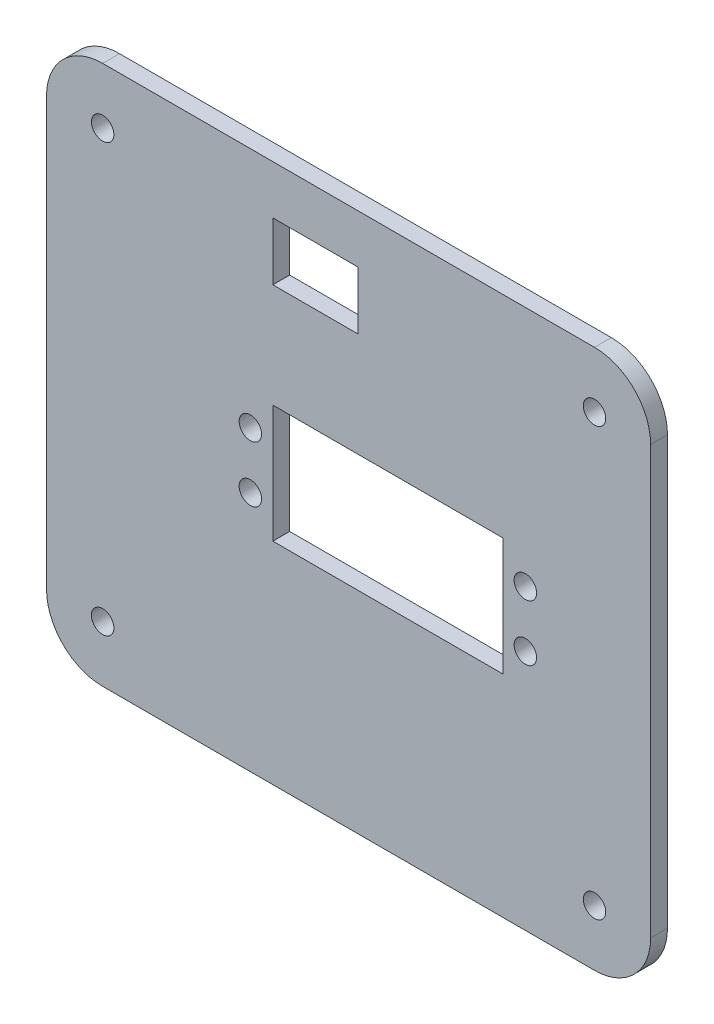
ISO-10303-21;
HEADER;
FILE_DESCRIPTION(('STEP AP214'),'2;1');
FILE_NAME('part.step','',(''),(''),'','','');
FILE_SCHEMA(('AUTOMOTIVE_DESIGN { 1 0 10303 214 1 1 1 1 }'));
ENDSEC;
DATA;
#1=APPLICATION_CONTEXT('core data for automotive mechanical design processes');
#2=APPLICATION_PROTOCOL_DEFINITION('international standard','automotive_design',2000,#1);
#3=PRODUCT_CONTEXT('',#1,'mechanical');
#4=PRODUCT('Part','Part','',(#3));
#5=PRODUCT_RELATED_PRODUCT_CATEGORY('part','',(#4));
#6=PRODUCT_DEFINITION_FORMATION('','',#4);
#7=PRODUCT_DEFINITION_CONTEXT('part definition',#1,'design');
#8=PRODUCT_DEFINITION('design','',#6,#7);
#9=PRODUCT_DEFINITION_SHAPE('','',#8);
#10=(LENGTH_UNIT() NAMED_UNIT(*) SI_UNIT(.MILLI.,.METRE.));
#11=(NAMED_UNIT(*) PLANE_ANGLE_UNIT() SI_UNIT($,.RADIAN.));
#12=(NAMED_UNIT(*) SI_UNIT($,.STERADIAN.) SOLID_ANGLE_UNIT());
#13=UNCERTAINTY_MEASURE_WITH_UNIT(LENGTH_MEASURE(1.E-05),#10,'distance_accuracy_value','');
#14=(GEOMETRIC_REPRESENTATION_CONTEXT(3) GLOBAL_UNCERTAINTY_ASSIGNED_CONTEXT((#13)) GLOBAL_UNIT_ASSIGNED_CONTEXT((#10,
#11,#12)) REPRESENTATION_CONTEXT('',''));
#15=CARTESIAN_POINT('',(0.,0.,0.));
#16=DIRECTION('',(0.,0.,1.));
#17=DIRECTION('',(1.,0.,0.));
#18=AXIS2_PLACEMENT_3D('',#15,#16,#17);
#19=CARTESIAN_POINT('',(17.253647696658,-20.6311797752809,0.));
#20=DIRECTION('',(0.,0.,1.));
#21=DIRECTION('',(1.,0.,0.));
#22=AXIS2_PLACEMENT_3D('',#19,#20,#21);
#23=CYLINDRICAL_SURFACE('',#22,2.);
#24=CARTESIAN_POINT('',(17.253647696658,-20.6311797752809,3.));
#25=DIRECTION('',(0.,0.,-1.));
#26=DIRECTION('',(1.,0.,0.));
#27=AXIS2_PLACEMENT_3D('',#24,#25,#26);
#28=CIRCLE('',#27,2.);
#29=CARTESIAN_POINT('',(15.253647696658,-20.6311797752809,3.));
#30=VERTEX_POINT('',#29);
#31=EDGE_CURVE('E43',#30,#30,#28,.T.);
#32=ORIENTED_EDGE('',*,*,#31,.F.);
#33=DIRECTION('',(0.,0.,-1.));
#34=VECTOR('',#33,1.);
#35=CARTESIAN_POINT('',(15.253647696658,-20.6311797752809,0.));
#36=LINE('',#35,#34);
#37=CARTESIAN_POINT('',(15.253647696658,-20.6311797752809,0.));
#38=VERTEX_POINT('',#37);
#39=EDGE_CURVE('E11',#30,#38,#36,.T.);
#40=ORIENTED_EDGE('',*,*,#39,.T.);
#41=CARTESIAN_POINT('',(17.253647696658,-20.6311797752809,0.));
#42=DIRECTION('',(0.,0.,1.));
#43=DIRECTION('',(1.,0.,0.));
#44=AXIS2_PLACEMENT_3D('',#41,#42,#43);
#45=CIRCLE('',#44,2.);
#46=EDGE_CURVE('E330',#38,#38,#45,.T.);
#47=ORIENTED_EDGE('',*,*,#46,.F.);
#48=ORIENTED_EDGE('',*,*,#39,.F.);
#49=EDGE_LOOP('',(#32,#40,#47,#48));
#50=FACE_BOUND('',#49,.T.);
#51=ADVANCED_FACE('F19',(#50),#23,.F.);
#52=CARTESIAN_POINT('',(-70.396352303342,-20.6311797752809,0.));
#53=DIRECTION('',(0.,0.,1.));
#54=DIRECTION('',(1.,0.,0.));
#55=AXIS2_PLACEMENT_3D('',#52,#53,#54);
#56=CYLINDRICAL_SURFACE('',#55,2.);
#57=CARTESIAN_POINT('',(-70.396352303342,-20.6311797752809,3.));
#58=DIRECTION('',(0.,0.,-1.));
#59=DIRECTION('',(1.,0.,0.));
#60=AXIS2_PLACEMENT_3D('',#57,#58,#59);
#61=CIRCLE('',#60,2.);
#62=CARTESIAN_POINT('',(-72.396352303342,-20.6311797752809,3.));
#63=VERTEX_POINT('',#62);
#64=EDGE_CURVE('E410',#63,#63,#61,.T.);
#65=ORIENTED_EDGE('',*,*,#64,.F.);
#66=DIRECTION('',(0.,0.,-1.));
#67=VECTOR('',#66,1.);
#68=CARTESIAN_POINT('',(-72.396352303342,-20.6311797752809,0.));
#69=LINE('',#68,#67);
#70=CARTESIAN_POINT('',(-72.396352303342,-20.6311797752809,0.));
#71=VERTEX_POINT('',#70);
#72=EDGE_CURVE('E30',#63,#71,#69,.T.);
#73=ORIENTED_EDGE('',*,*,#72,.T.);
#74=CARTESIAN_POINT('',(-70.396352303342,-20.6311797752809,0.));
#75=DIRECTION('',(0.,0.,1.));
#76=DIRECTION('',(1.,0.,0.));
#77=AXIS2_PLACEMENT_3D('',#74,#75,#76);
#78=CIRCLE('',#77,2.);
#79=EDGE_CURVE('E325',#71,#71,#78,.T.);
#80=ORIENTED_EDGE('',*,*,#79,.F.);
#81=ORIENTED_EDGE('',*,*,#72,.F.);
#82=EDGE_LOOP('',(#65,#73,#80,#81));
#83=FACE_BOUND('',#82,.T.);
#84=ADVANCED_FACE('F779',(#83),#56,.F.);
#85=CARTESIAN_POINT('',(-70.396352303342,55.5188202247191,0.));
#86=DIRECTION('',(0.,0.,1.));
#87=DIRECTION('',(1.,0.,0.));
#88=AXIS2_PLACEMENT_3D('',#85,#86,#87);
#89=CYLINDRICAL_SURFACE('',#88,2.);
#90=CARTESIAN_POINT('',(-70.396352303342,55.5188202247191,3.));
#91=DIRECTION('',(0.,0.,-1.));
#92=DIRECTION('',(1.,0.,0.));
#93=AXIS2_PLACEMENT_3D('',#90,#91,#92);
#94=CIRCLE('',#93,2.);
#95=CARTESIAN_POINT('',(-72.396352303342,55.5188202247191,3.));
#96=VERTEX_POINT('',#95);
#97=EDGE_CURVE('E394',#96,#96,#94,.T.);
#98=ORIENTED_EDGE('',*,*,#97,.F.);
#99=DIRECTION('',(0.,0.,-1.));
#100=VECTOR('',#99,1.);
#101=CARTESIAN_POINT('',(-72.396352303342,55.5188202247191,0.));
#102=LINE('',#101,#100);
#103=CARTESIAN_POINT('',(-72.396352303342,55.5188202247191,0.));
#104=VERTEX_POINT('',#103);
#105=EDGE_CURVE('E324',#96,#104,#102,.T.);
#106=ORIENTED_EDGE('',*,*,#105,.T.);
#107=CARTESIAN_POINT('',(-70.396352303342,55.5188202247191,0.));
#108=DIRECTION('',(0.,0.,1.));
#109=DIRECTION('',(1.,0.,0.));
#110=AXIS2_PLACEMENT_3D('',#107,#108,#109);
#111=CIRCLE('',#110,2.);
#112=EDGE_CURVE('E329',#104,#104,#111,.T.);
#113=ORIENTED_EDGE('',*,*,#112,.F.);
#114=ORIENTED_EDGE('',*,*,#105,.F.);
#115=EDGE_LOOP('',(#98,#106,#113,#114));
#116=FACE_BOUND('',#115,.T.);
#117=ADVANCED_FACE('F644',(#116),#89,.F.);
#118=CARTESIAN_POINT('',(17.253647696658,55.5188202247191,0.));
#119=DIRECTION('',(0.,0.,1.));
#120=DIRECTION('',(1.,0.,0.));
#121=AXIS2_PLACEMENT_3D('',#118,#119,#120);
#122=CYLINDRICAL_SURFACE('',#121,2.);
#123=CARTESIAN_POINT('',(17.253647696658,55.5188202247191,3.));
#124=DIRECTION('',(0.,0.,-1.));
#125=DIRECTION('',(1.,0.,0.));
#126=AXIS2_PLACEMENT_3D('',#123,#124,#125);
#127=CIRCLE('',#126,2.);
#128=CARTESIAN_POINT('',(15.253647696658,55.5188202247191,3.));
#129=VERTEX_POINT('',#128);
#130=EDGE_CURVE('E232',#129,#129,#127,.T.);
#131=ORIENTED_EDGE('',*,*,#130,.F.);
#132=DIRECTION('',(0.,0.,-1.));
#133=VECTOR('',#132,1.);
#134=CARTESIAN_POINT('',(15.253647696658,55.5188202247191,0.));
#135=LINE('',#134,#133);
#136=CARTESIAN_POINT('',(15.253647696658,55.5188202247191,0.));
#137=VERTEX_POINT('',#136);
#138=EDGE_CURVE('E242',#129,#137,#135,.T.);
#139=ORIENTED_EDGE('',*,*,#138,.T.);
#140=CARTESIAN_POINT('',(17.253647696658,55.5188202247191,0.));
#141=DIRECTION('',(0.,0.,1.));
#142=DIRECTION('',(1.,0.,0.));
#143=AXIS2_PLACEMENT_3D('',#140,#141,#142);
#144=CIRCLE('',#143,2.);
#145=EDGE_CURVE('E390',#137,#137,#144,.T.);
#146=ORIENTED_EDGE('',*,*,#145,.F.);
#147=ORIENTED_EDGE('',*,*,#138,.F.);
#148=EDGE_LOOP('',(#131,#139,#146,#147));
#149=FACE_BOUND('',#148,.T.);
#150=ADVANCED_FACE('F639',(#149),#122,.F.);
#151=CARTESIAN_POINT('',(-24.8978907195704,46.5079701020286,0.));
#152=DIRECTION('',(0.,1.,0.));
#153=DIRECTION('',(1.,0.,0.));
#154=AXIS2_PLACEMENT_3D('',#151,#152,#153);
#155=PLANE('',#154);
#156=DIRECTION('',(1.,0.,0.));
#157=VECTOR('',#156,1.);
#158=CARTESIAN_POINT('',(-40.071352303342,46.5079701020286,0.));
#159=LINE('',#158,#157);
#160=CARTESIAN_POINT('',(-40.071352303342,46.5079701020286,0.));
#161=VERTEX_POINT('',#160);
#162=CARTESIAN_POINT('',(-24.8978907195704,46.5079701020286,0.));
#163=VERTEX_POINT('',#162);
#164=EDGE_CURVE('E237',#161,#163,#159,.T.);
#165=ORIENTED_EDGE('',*,*,#164,.F.);
#166=DIRECTION('',(0.,0.,1.));
#167=VECTOR('',#166,1.);
#168=CARTESIAN_POINT('',(-40.071352303342,46.5079701020286,0.));
#169=LINE('',#168,#167);
#170=CARTESIAN_POINT('',(-40.071352303342,46.5079701020286,3.));
#171=VERTEX_POINT('',#170);
#172=EDGE_CURVE('E235',#161,#171,#169,.T.);
#173=ORIENTED_EDGE('',*,*,#172,.T.);
#174=DIRECTION('',(-1.,0.,0.));
#175=VECTOR('',#174,1.);
#176=CARTESIAN_POINT('',(-40.071352303342,46.5079701020286,3.));
#177=LINE('',#176,#175);
#178=CARTESIAN_POINT('',(-24.8978907195704,46.5079701020286,3.));
#179=VERTEX_POINT('',#178);
#180=EDGE_CURVE('E220',#179,#171,#177,.T.);
#181=ORIENTED_EDGE('',*,*,#180,.F.);
#182=DIRECTION('',(0.,0.,1.));
#183=VECTOR('',#182,1.);
#184=CARTESIAN_POINT('',(-24.8978907195704,46.5079701020286,0.));
#185=LINE('',#184,#183);
#186=EDGE_CURVE('E290',#163,#179,#185,.T.);
#187=ORIENTED_EDGE('',*,*,#186,.F.);
#188=EDGE_LOOP('',(#165,#173,#181,#187));
#189=FACE_BOUND('',#188,.T.);
#190=ADVANCED_FACE('F236',(#189),#155,.T.);
#191=CARTESIAN_POINT('',(-24.8978907195704,56.834114169103,0.));
#192=DIRECTION('',(-1.,0.,0.));
#193=DIRECTION('',(0.,0.,1.));
#194=AXIS2_PLACEMENT_3D('',#191,#192,#193);
#195=PLANE('',#194);
#196=DIRECTION('',(0.,-1.,0.));
#197=VECTOR('',#196,1.);
#198=CARTESIAN_POINT('',(-24.8978907195704,56.834114169103,0.));
#199=LINE('',#198,#197);
#200=CARTESIAN_POINT('',(-24.8978907195704,56.834114169103,0.));
#201=VERTEX_POINT('',#200);
#202=EDGE_CURVE('E243',#201,#163,#199,.T.);
#203=ORIENTED_EDGE('',*,*,#202,.T.);
#204=ORIENTED_EDGE('',*,*,#186,.T.);
#205=DIRECTION('',(0.,-1.,0.));
#206=VECTOR('',#205,1.);
#207=CARTESIAN_POINT('',(-24.8978907195704,56.834114169103,3.));
#208=LINE('',#207,#206);
#209=CARTESIAN_POINT('',(-24.8978907195704,56.834114169103,3.));
#210=VERTEX_POINT('',#209);
#211=EDGE_CURVE('E227',#210,#179,#208,.T.);
#212=ORIENTED_EDGE('',*,*,#211,.F.);
#213=DIRECTION('',(0.,0.,1.));
#214=VECTOR('',#213,1.);
#215=CARTESIAN_POINT('',(-24.8978907195704,56.834114169103,0.));
#216=LINE('',#215,#214);
#217=EDGE_CURVE('E272',#201,#210,#216,.T.);
#218=ORIENTED_EDGE('',*,*,#217,.F.);
#219=EDGE_LOOP('',(#203,#204,#212,#218));
#220=FACE_BOUND('',#219,.T.);
#221=ADVANCED_FACE('F594',(#220),#195,.T.);
#222=CARTESIAN_POINT('',(-40.071352303342,56.834114169103,0.));
#223=DIRECTION('',(0.,-1.,0.));
#224=DIRECTION('',(0.,0.,-1.));
#225=AXIS2_PLACEMENT_3D('',#222,#223,#224);
#226=PLANE('',#225);
#227=DIRECTION('',(1.,0.,0.));
#228=VECTOR('',#227,1.);
#229=CARTESIAN_POINT('',(-40.071352303342,56.834114169103,0.));
#230=LINE('',#229,#228);
#231=CARTESIAN_POINT('',(-40.071352303342,56.834114169103,0.));
#232=VERTEX_POINT('',#231);
#233=EDGE_CURVE('E436',#232,#201,#230,.T.);
#234=ORIENTED_EDGE('',*,*,#233,.T.);
#235=ORIENTED_EDGE('',*,*,#217,.T.);
#236=DIRECTION('',(1.,0.,0.));
#237=VECTOR('',#236,1.);
#238=CARTESIAN_POINT('',(-40.071352303342,56.834114169103,3.));
#239=LINE('',#238,#237);
#240=CARTESIAN_POINT('',(-40.071352303342,56.834114169103,3.));
#241=VERTEX_POINT('',#240);
#242=EDGE_CURVE('E250',#241,#210,#239,.T.);
#243=ORIENTED_EDGE('',*,*,#242,.F.);
#244=DIRECTION('',(0.,0.,1.));
#245=VECTOR('',#244,1.);
#246=CARTESIAN_POINT('',(-40.071352303342,56.834114169103,0.));
#247=LINE('',#246,#245);
#248=EDGE_CURVE('E247',#232,#241,#247,.T.);
#249=ORIENTED_EDGE('',*,*,#248,.F.);
#250=EDGE_LOOP('',(#234,#235,#243,#249));
#251=FACE_BOUND('',#250,.T.);
#252=ADVANCED_FACE('F589',(#251),#226,.T.);
#253=CARTESIAN_POINT('',(-40.071352303342,46.5079701020286,0.));
#254=DIRECTION('',(1.,0.,0.));
#255=DIRECTION('',(0.,1.,0.));
#256=AXIS2_PLACEMENT_3D('',#253,#254,#255);
#257=PLANE('',#256);
#258=DIRECTION('',(0.,1.,0.));
#259=VECTOR('',#258,1.);
#260=CARTESIAN_POINT('',(-40.071352303342,46.5079701020286,0.));
#261=LINE('',#260,#259);
#262=EDGE_CURVE('E269',#161,#232,#261,.T.);
#263=ORIENTED_EDGE('',*,*,#262,.T.);
#264=ORIENTED_EDGE('',*,*,#248,.T.);
#265=DIRECTION('',(0.,1.,0.));
#266=VECTOR('',#265,1.);
#267=CARTESIAN_POINT('',(-40.071352303342,46.5079701020286,3.));
#268=LINE('',#267,#266);
#269=EDGE_CURVE('E226',#171,#241,#268,.T.);
#270=ORIENTED_EDGE('',*,*,#269,.F.);
#271=ORIENTED_EDGE('',*,*,#172,.F.);
#272=EDGE_LOOP('',(#263,#264,#270,#271));
#273=FACE_BOUND('',#272,.T.);
#274=ADVANCED_FACE('F246',(#273),#257,.T.);
#275=CARTESIAN_POINT('',(0.928647696657979,27.9438202247191,0.));
#276=DIRECTION('',(-1.,0.,0.));
#277=DIRECTION('',(0.,1.,0.));
#278=AXIS2_PLACEMENT_3D('',#275,#276,#277);
#279=PLANE('',#278);
#280=DIRECTION('',(0.,-1.,0.));
#281=VECTOR('',#280,1.);
#282=CARTESIAN_POINT('',(0.928647696657979,27.9438202247191,0.));
#283=LINE('',#282,#281);
#284=CARTESIAN_POINT('',(0.928647696657983,27.9438202247191,0.));
#285=VERTEX_POINT('',#284);
#286=CARTESIAN_POINT('',(0.928647696657981,6.94382022471908,0.));
#287=VERTEX_POINT('',#286);
#288=EDGE_CURVE('E23',#285,#287,#283,.T.);
#289=ORIENTED_EDGE('',*,*,#288,.T.);
#290=DIRECTION('',(0.,0.,1.));
#291=VECTOR('',#290,1.);
#292=CARTESIAN_POINT('',(0.928647696657981,6.94382022471908,0.));
#293=LINE('',#292,#291);
#294=CARTESIAN_POINT('',(0.92864769665798,6.94382022471908,3.));
#295=VERTEX_POINT('',#294);
#296=EDGE_CURVE('E347',#287,#295,#293,.T.);
#297=ORIENTED_EDGE('',*,*,#296,.T.);
#298=DIRECTION('',(0.,-1.,0.));
#299=VECTOR('',#298,1.);
#300=CARTESIAN_POINT('',(0.928647696657979,27.9438202247191,3.));
#301=LINE('',#300,#299);
#302=CARTESIAN_POINT('',(0.928647696657983,27.9438202247191,3.));
#303=VERTEX_POINT('',#302);
#304=EDGE_CURVE('E249',#303,#295,#301,.T.);
#305=ORIENTED_EDGE('',*,*,#304,.F.);
#306=DIRECTION('',(0.,0.,1.));
#307=VECTOR('',#306,1.);
#308=CARTESIAN_POINT('',(0.928647696657983,27.9438202247191,0.));
#309=LINE('',#308,#307);
#310=EDGE_CURVE('E291',#285,#303,#309,.T.);
#311=ORIENTED_EDGE('',*,*,#310,.F.);
#312=EDGE_LOOP('',(#289,#297,#305,#311));
#313=FACE_BOUND('',#312,.T.);
#314=ADVANCED_FACE('F688',(#313),#279,.T.);
#315=CARTESIAN_POINT('',(-40.071352303342,27.9438202247191,0.));
#316=DIRECTION('',(0.,-1.,0.));
#317=DIRECTION('',(0.,0.,-1.));
#318=AXIS2_PLACEMENT_3D('',#315,#316,#317);
#319=PLANE('',#318);
#320=DIRECTION('',(1.,0.,0.));
#321=VECTOR('',#320,1.);
#322=CARTESIAN_POINT('',(-40.071352303342,27.9438202247191,0.));
#323=LINE('',#322,#321);
#324=CARTESIAN_POINT('',(-40.071352303342,27.9438202247191,0.));
#325=VERTEX_POINT('',#324);
#326=EDGE_CURVE('E295',#325,#285,#323,.T.);
#327=ORIENTED_EDGE('',*,*,#326,.T.);
#328=ORIENTED_EDGE('',*,*,#310,.T.);
#329=DIRECTION('',(1.,0.,0.));
#330=VECTOR('',#329,1.);
#331=CARTESIAN_POINT('',(-40.071352303342,27.9438202247191,3.));
#332=LINE('',#331,#330);
#333=CARTESIAN_POINT('',(-40.071352303342,27.9438202247191,3.));
#334=VERTEX_POINT('',#333);
#335=EDGE_CURVE('E257',#334,#303,#332,.T.);
#336=ORIENTED_EDGE('',*,*,#335,.F.);
#337=DIRECTION('',(0.,0.,1.));
#338=VECTOR('',#337,1.);
#339=CARTESIAN_POINT('',(-40.071352303342,27.9438202247191,0.));
#340=LINE('',#339,#338);
#341=EDGE_CURVE('E422',#325,#334,#340,.T.);
#342=ORIENTED_EDGE('',*,*,#341,.F.);
#343=EDGE_LOOP('',(#327,#328,#336,#342));
#344=FACE_BOUND('',#343,.T.);
#345=ADVANCED_FACE('F704',(#344),#319,.T.);
#346=CARTESIAN_POINT('',(-40.071352303342,6.94382022471907,0.));
#347=DIRECTION('',(1.,0.,0.));
#348=DIRECTION('',(0.,1.,0.));
#349=AXIS2_PLACEMENT_3D('',#346,#347,#348);
#350=PLANE('',#349);
#351=DIRECTION('',(0.,1.,0.));
#352=VECTOR('',#351,1.);
#353=CARTESIAN_POINT('',(-40.071352303342,6.94382022471907,0.));
#354=LINE('',#353,#352);
#355=CARTESIAN_POINT('',(-40.071352303342,6.94382022471907,0.));
#356=VERTEX_POINT('',#355);
#357=EDGE_CURVE('E296',#356,#325,#354,.T.);
#358=ORIENTED_EDGE('',*,*,#357,.T.);
#359=ORIENTED_EDGE('',*,*,#341,.T.);
#360=DIRECTION('',(0.,1.,0.));
#361=VECTOR('',#360,1.);
#362=CARTESIAN_POINT('',(-40.071352303342,6.94382022471907,3.));
#363=LINE('',#362,#361);
#364=CARTESIAN_POINT('',(-40.071352303342,6.94382022471907,3.));
#365=VERTEX_POINT('',#364);
#366=EDGE_CURVE('E395',#365,#334,#363,.T.);
#367=ORIENTED_EDGE('',*,*,#366,.F.);
#368=DIRECTION('',(0.,0.,1.));
#369=VECTOR('',#368,1.);
#370=CARTESIAN_POINT('',(-40.071352303342,6.94382022471907,0.));
#371=LINE('',#370,#369);
#372=EDGE_CURVE('E331',#356,#365,#371,.T.);
#373=ORIENTED_EDGE('',*,*,#372,.F.);
#374=EDGE_LOOP('',(#358,#359,#367,#373));
#375=FACE_BOUND('',#374,.T.);
#376=ADVANCED_FACE('F677',(#375),#350,.T.);
#377=CARTESIAN_POINT('',(0.928647696657981,6.94382022471908,0.));
#378=DIRECTION('',(0.,1.,0.));
#379=DIRECTION('',(1.,0.,0.));
#380=AXIS2_PLACEMENT_3D('',#377,#378,#379);
#381=PLANE('',#380);
#382=DIRECTION('',(-1.,0.,0.));
#383=VECTOR('',#382,1.);
#384=CARTESIAN_POINT('',(0.928647696657981,6.94382022471908,0.));
#385=LINE('',#384,#383);
#386=EDGE_CURVE('E335',#287,#356,#385,.T.);
#387=ORIENTED_EDGE('',*,*,#386,.T.);
#388=ORIENTED_EDGE('',*,*,#372,.T.);
#389=DIRECTION('',(-1.,0.,0.));
#390=VECTOR('',#389,1.);
#391=CARTESIAN_POINT('',(0.928647696657981,6.94382022471908,3.));
#392=LINE('',#391,#390);
#393=EDGE_CURVE('E399',#295,#365,#392,.T.);
#394=ORIENTED_EDGE('',*,*,#393,.F.);
#395=ORIENTED_EDGE('',*,*,#296,.F.);
#396=EDGE_LOOP('',(#387,#388,#394,#395));
#397=FACE_BOUND('',#396,.T.);
#398=ADVANCED_FACE('F666',(#397),#381,.T.);
#399=CARTESIAN_POINT('',(-44.071352303342,22.4438202247191,0.));
#400=DIRECTION('',(0.,0.,1.));
#401=DIRECTION('',(1.,0.,0.));
#402=AXIS2_PLACEMENT_3D('',#399,#400,#401);
#403=CYLINDRICAL_SURFACE('',#402,2.);
#404=CARTESIAN_POINT('',(-44.071352303342,22.4438202247191,3.));
#405=DIRECTION('',(0.,0.,-1.));
#406=DIRECTION('',(1.,0.,0.));
#407=AXIS2_PLACEMENT_3D('',#404,#405,#406);
#408=CIRCLE('',#407,2.);
#409=CARTESIAN_POINT('',(-46.071352303342,22.4438202247191,3.));
#410=VERTEX_POINT('',#409);
#411=EDGE_CURVE('E379',#410,#410,#408,.T.);
#412=ORIENTED_EDGE('',*,*,#411,.F.);
#413=DIRECTION('',(0.,0.,-1.));
#414=VECTOR('',#413,1.);
#415=CARTESIAN_POINT('',(-46.071352303342,22.4438202247191,0.));
#416=LINE('',#415,#414);
#417=CARTESIAN_POINT('',(-46.071352303342,22.4438202247191,0.));
#418=VERTEX_POINT('',#417);
#419=EDGE_CURVE('E336',#410,#418,#416,.T.);
#420=ORIENTED_EDGE('',*,*,#419,.T.);
#421=CARTESIAN_POINT('',(-44.071352303342,22.4438202247191,0.));
#422=DIRECTION('',(0.,0.,1.));
#423=DIRECTION('',(1.,0.,0.));
#424=AXIS2_PLACEMENT_3D('',#421,#422,#423);
#425=CIRCLE('',#424,2.);
#426=EDGE_CURVE('E406',#418,#418,#425,.T.);
#427=ORIENTED_EDGE('',*,*,#426,.F.);
#428=ORIENTED_EDGE('',*,*,#419,.F.);
#429=EDGE_LOOP('',(#412,#420,#427,#428));
#430=FACE_BOUND('',#429,.T.);
#431=ADVANCED_FACE('F661',(#430),#403,.F.);
#432=CARTESIAN_POINT('',(4.92864769665798,22.4438202247191,0.));
#433=DIRECTION('',(0.,0.,1.));
#434=DIRECTION('',(1.,0.,0.));
#435=AXIS2_PLACEMENT_3D('',#432,#433,#434);
#436=CYLINDRICAL_SURFACE('',#435,2.);
#437=CARTESIAN_POINT('',(4.92864769665798,22.4438202247191,3.));
#438=DIRECTION('',(0.,0.,-1.));
#439=DIRECTION('',(1.,0.,0.));
#440=AXIS2_PLACEMENT_3D('',#437,#438,#439);
#441=CIRCLE('',#440,2.);
#442=CARTESIAN_POINT('',(2.92864769665798,22.4438202247191,3.));
#443=VERTEX_POINT('',#442);
#444=EDGE_CURVE('E374',#443,#443,#441,.T.);
#445=ORIENTED_EDGE('',*,*,#444,.F.);
#446=DIRECTION('',(0.,0.,-1.));
#447=VECTOR('',#446,1.);
#448=CARTESIAN_POINT('',(2.92864769665798,22.4438202247191,0.));
#449=LINE('',#448,#447);
#450=CARTESIAN_POINT('',(2.92864769665798,22.4438202247191,0.));
#451=VERTEX_POINT('',#450);
#452=EDGE_CURVE('E373',#443,#451,#449,.T.);
#453=ORIENTED_EDGE('',*,*,#452,.T.);
#454=CARTESIAN_POINT('',(4.92864769665798,22.4438202247191,0.));
#455=DIRECTION('',(0.,0.,1.));
#456=DIRECTION('',(1.,0.,0.));
#457=AXIS2_PLACEMENT_3D('',#454,#455,#456);
#458=CIRCLE('',#457,2.);
#459=EDGE_CURVE('E286',#451,#451,#458,.T.);
#460=ORIENTED_EDGE('',*,*,#459,.F.);
#461=ORIENTED_EDGE('',*,*,#452,.F.);
#462=EDGE_LOOP('',(#445,#453,#460,#461));
#463=FACE_BOUND('',#462,.T.);
#464=ADVANCED_FACE('F581',(#463),#436,.F.);
#465=CARTESIAN_POINT('',(4.92864769665799,12.4438202247191,0.));
#466=DIRECTION('',(0.,0.,1.));
#467=DIRECTION('',(1.,0.,0.));
#468=AXIS2_PLACEMENT_3D('',#465,#466,#467);
#469=CYLINDRICAL_SURFACE('',#468,2.);
#470=CARTESIAN_POINT('',(4.92864769665799,12.4438202247191,3.));
#471=DIRECTION('',(0.,0.,-1.));
#472=DIRECTION('',(1.,0.,0.));
#473=AXIS2_PLACEMENT_3D('',#470,#471,#472);
#474=CIRCLE('',#473,2.);
#475=CARTESIAN_POINT('',(2.92864769665798,12.4438202247191,3.));
#476=VERTEX_POINT('',#475);
#477=EDGE_CURVE('E378',#476,#476,#474,.T.);
#478=ORIENTED_EDGE('',*,*,#477,.F.);
#479=DIRECTION('',(0.,0.,-1.));
#480=VECTOR('',#479,1.);
#481=CARTESIAN_POINT('',(2.92864769665798,12.4438202247191,0.));
#482=LINE('',#481,#480);
#483=CARTESIAN_POINT('',(2.92864769665798,12.4438202247191,0.));
#484=VERTEX_POINT('',#483);
#485=EDGE_CURVE('E432',#476,#484,#482,.T.);
#486=ORIENTED_EDGE('',*,*,#485,.T.);
#487=CARTESIAN_POINT('',(4.92864769665799,12.4438202247191,0.));
#488=DIRECTION('',(0.,0.,1.));
#489=DIRECTION('',(1.,0.,0.));
#490=AXIS2_PLACEMENT_3D('',#487,#488,#489);
#491=CIRCLE('',#490,2.);
#492=EDGE_CURVE('E281',#484,#484,#491,.T.);
#493=ORIENTED_EDGE('',*,*,#492,.F.);
#494=ORIENTED_EDGE('',*,*,#485,.F.);
#495=EDGE_LOOP('',(#478,#486,#493,#494));
#496=FACE_BOUND('',#495,.T.);
#497=ADVANCED_FACE('F576',(#496),#469,.F.);
#498=CARTESIAN_POINT('',(-44.071352303342,12.4438202247191,0.));
#499=DIRECTION('',(0.,0.,1.));
#500=DIRECTION('',(1.,0.,0.));
#501=AXIS2_PLACEMENT_3D('',#498,#499,#500);
#502=CYLINDRICAL_SURFACE('',#501,2.);
#503=CARTESIAN_POINT('',(-44.071352303342,12.4438202247191,3.));
#504=DIRECTION('',(0.,0.,-1.));
#505=DIRECTION('',(1.,0.,0.));
#506=AXIS2_PLACEMENT_3D('',#503,#504,#505);
#507=CIRCLE('',#506,2.);
#508=CARTESIAN_POINT('',(-46.071352303342,12.4438202247191,3.));
#509=VERTEX_POINT('',#508);
#510=EDGE_CURVE('E466',#509,#509,#507,.T.);
#511=ORIENTED_EDGE('',*,*,#510,.F.);
#512=DIRECTION('',(0.,0.,-1.));
#513=VECTOR('',#512,1.);
#514=CARTESIAN_POINT('',(-46.071352303342,12.4438202247191,0.));
#515=LINE('',#514,#513);
#516=CARTESIAN_POINT('',(-46.071352303342,12.4438202247191,0.));
#517=VERTEX_POINT('',#516);
#518=EDGE_CURVE('E306',#509,#517,#515,.T.);
#519=ORIENTED_EDGE('',*,*,#518,.T.);
#520=CARTESIAN_POINT('',(-44.071352303342,12.4438202247191,0.));
#521=DIRECTION('',(0.,0.,1.));
#522=DIRECTION('',(1.,0.,0.));
#523=AXIS2_PLACEMENT_3D('',#520,#521,#522);
#524=CIRCLE('',#523,2.);
#525=EDGE_CURVE('E285',#517,#517,#524,.T.);
#526=ORIENTED_EDGE('',*,*,#525,.F.);
#527=ORIENTED_EDGE('',*,*,#518,.F.);
#528=EDGE_LOOP('',(#511,#519,#526,#527));
#529=FACE_BOUND('',#528,.T.);
#530=ADVANCED_FACE('F558',(#529),#502,.F.);
#531=CARTESIAN_POINT('',(-70.396352303342,-30.6311797752809,0.));
#532=DIRECTION('',(0.,-1.,0.));
#533=DIRECTION('',(0.,0.,-1.));
#534=AXIS2_PLACEMENT_3D('',#531,#532,#533);
#535=PLANE('',#534);
#536=DIRECTION('',(1.,0.,0.));
#537=VECTOR('',#536,1.);
#538=CARTESIAN_POINT('',(-70.396352303342,-30.6311797752809,0.));
#539=LINE('',#538,#537);
#540=CARTESIAN_POINT('',(-70.396352303342,-30.6311797752809,0.));
#541=VERTEX_POINT('',#540);
#542=CARTESIAN_POINT('',(17.253647696658,-30.6311797752809,0.));
#543=VERTEX_POINT('',#542);
#544=EDGE_CURVE('E302',#541,#543,#539,.T.);
#545=ORIENTED_EDGE('',*,*,#544,.T.);
#546=DIRECTION('',(0.,0.,1.));
#547=VECTOR('',#546,1.);
#548=CARTESIAN_POINT('',(17.253647696658,-30.6311797752809,0.));
#549=LINE('',#548,#547);
#550=CARTESIAN_POINT('',(17.253647696658,-30.6311797752809,3.));
#551=VERTEX_POINT('',#550);
#552=EDGE_CURVE('E307',#543,#551,#549,.T.);
#553=ORIENTED_EDGE('',*,*,#552,.T.);
#554=DIRECTION('',(1.,0.,0.));
#555=VECTOR('',#554,1.);
#556=CARTESIAN_POINT('',(-70.396352303342,-30.6311797752809,3.));
#557=LINE('',#556,#555);
#558=CARTESIAN_POINT('',(-70.396352303342,-30.6311797752809,3.));
#559=VERTEX_POINT('',#558);
#560=EDGE_CURVE('E463',#559,#551,#557,.T.);
#561=ORIENTED_EDGE('',*,*,#560,.F.);
#562=DIRECTION('',(0.,0.,1.));
#563=VECTOR('',#562,1.);
#564=CARTESIAN_POINT('',(-70.396352303342,-30.6311797752809,0.));
#565=LINE('',#564,#563);
#566=EDGE_CURVE('E448',#541,#559,#565,.T.);
#567=ORIENTED_EDGE('',*,*,#566,.F.);
#568=EDGE_LOOP('',(#545,#553,#561,#567));
#569=FACE_BOUND('',#568,.T.);
#570=ADVANCED_FACE('F21',(#569),#535,.T.);
#571=CARTESIAN_POINT('',(-70.396352303342,-20.6311797752809,0.));
#572=DIRECTION('',(0.,0.,1.));
#573=DIRECTION('',(-1.,0.,0.));
#574=AXIS2_PLACEMENT_3D('',#571,#572,#573);
#575=CYLINDRICAL_SURFACE('',#574,10.);
#576=CARTESIAN_POINT('',(-70.396352303342,-20.6311797752809,0.));
#577=DIRECTION('',(0.,0.,1.));
#578=DIRECTION('',(-1.,0.,0.));
#579=AXIS2_PLACEMENT_3D('',#576,#577,#578);
#580=CIRCLE('',#579,10.);
#581=CARTESIAN_POINT('',(-80.396352303342,-20.6311797752809,0.));
#582=VERTEX_POINT('',#581);
#583=EDGE_CURVE('E262',#582,#541,#580,.T.);
#584=ORIENTED_EDGE('',*,*,#583,.T.);
#585=ORIENTED_EDGE('',*,*,#566,.T.);
#586=CARTESIAN_POINT('',(-70.396352303342,-20.6311797752809,3.));
#587=DIRECTION('',(0.,0.,1.));
#588=DIRECTION('',(-1.,0.,0.));
#589=AXIS2_PLACEMENT_3D('',#586,#587,#588);
#590=CIRCLE('',#589,10.);
#591=CARTESIAN_POINT('',(-80.396352303342,-20.6311797752809,3.));
#592=VERTEX_POINT('',#591);
#593=EDGE_CURVE('E383',#592,#559,#590,.T.);
#594=ORIENTED_EDGE('',*,*,#593,.F.);
#595=DIRECTION('',(0.,0.,1.));
#596=VECTOR('',#595,1.);
#597=CARTESIAN_POINT('',(-80.396352303342,-20.6311797752809,0.));
#598=LINE('',#597,#596);
#599=EDGE_CURVE('E355',#582,#592,#598,.T.);
#600=ORIENTED_EDGE('',*,*,#599,.F.);
#601=EDGE_LOOP('',(#584,#585,#594,#600));
#602=FACE_BOUND('',#601,.T.);
#603=ADVANCED_FACE('F513',(#602),#575,.T.);
#604=CARTESIAN_POINT('',(-80.396352303342,55.5188202247191,0.));
#605=DIRECTION('',(-1.,0.,0.));
#606=DIRECTION('',(0.,0.,1.));
#607=AXIS2_PLACEMENT_3D('',#604,#605,#606);
#608=PLANE('',#607);
#609=DIRECTION('',(0.,-1.,0.));
#610=VECTOR('',#609,1.);
#611=CARTESIAN_POINT('',(-80.396352303342,55.5188202247191,0.));
#612=LINE('',#611,#610);
#613=CARTESIAN_POINT('',(-80.396352303342,55.5188202247191,0.));
#614=VERTEX_POINT('',#613);
#615=EDGE_CURVE('E363',#614,#582,#612,.T.);
#616=ORIENTED_EDGE('',*,*,#615,.T.);
#617=ORIENTED_EDGE('',*,*,#599,.T.);
#618=DIRECTION('',(0.,-1.,0.));
#619=VECTOR('',#618,1.);
#620=CARTESIAN_POINT('',(-80.396352303342,55.5188202247191,3.));
#621=LINE('',#620,#619);
#622=CARTESIAN_POINT('',(-80.396352303342,55.5188202247191,3.));
#623=VERTEX_POINT('',#622);
#624=EDGE_CURVE('E317',#623,#592,#621,.T.);
#625=ORIENTED_EDGE('',*,*,#624,.F.);
#626=DIRECTION('',(0.,0.,1.));
#627=VECTOR('',#626,1.);
#628=CARTESIAN_POINT('',(-80.396352303342,55.5188202247191,0.));
#629=LINE('',#628,#627);
#630=EDGE_CURVE('E340',#614,#623,#629,.T.);
#631=ORIENTED_EDGE('',*,*,#630,.F.);
#632=EDGE_LOOP('',(#616,#617,#625,#631));
#633=FACE_BOUND('',#632,.T.);
#634=ADVANCED_FACE('F522',(#633),#608,.T.);
#635=CARTESIAN_POINT('',(-70.396352303342,55.5188202247191,0.));
#636=DIRECTION('',(0.,0.,1.));
#637=DIRECTION('',(0.,1.,0.));
#638=AXIS2_PLACEMENT_3D('',#635,#636,#637);
#639=CYLINDRICAL_SURFACE('',#638,10.);
#640=CARTESIAN_POINT('',(-70.396352303342,55.5188202247191,0.));
#641=DIRECTION('',(0.,0.,1.));
#642=DIRECTION('',(0.,1.,0.));
#643=AXIS2_PLACEMENT_3D('',#640,#641,#642);
#644=CIRCLE('',#643,10.);
#645=CARTESIAN_POINT('',(-70.396352303342,65.5188202247191,0.));
#646=VERTEX_POINT('',#645);
#647=EDGE_CURVE('E351',#646,#614,#644,.T.);
#648=ORIENTED_EDGE('',*,*,#647,.T.);
#649=ORIENTED_EDGE('',*,*,#630,.T.);
#650=CARTESIAN_POINT('',(-70.396352303342,55.5188202247191,3.));
#651=DIRECTION('',(0.,0.,1.));
#652=DIRECTION('',(0.,1.,0.));
#653=AXIS2_PLACEMENT_3D('',#650,#651,#652);
#654=CIRCLE('',#653,10.);
#655=CARTESIAN_POINT('',(-70.396352303342,65.5188202247191,3.));
#656=VERTEX_POINT('',#655);
#657=EDGE_CURVE('E313',#656,#623,#654,.T.);
#658=ORIENTED_EDGE('',*,*,#657,.F.);
#659=DIRECTION('',(0.,0.,1.));
#660=VECTOR('',#659,1.);
#661=CARTESIAN_POINT('',(-70.396352303342,65.5188202247191,0.));
#662=LINE('',#661,#660);
#663=EDGE_CURVE('E263',#646,#656,#662,.T.);
#664=ORIENTED_EDGE('',*,*,#663,.F.);
#665=EDGE_LOOP('',(#648,#649,#658,#664));
#666=FACE_BOUND('',#665,.T.);
#667=ADVANCED_FACE('F524',(#666),#639,.T.);
#668=CARTESIAN_POINT('',(17.253647696658,65.5188202247191,0.));
#669=DIRECTION('',(0.,1.,0.));
#670=DIRECTION('',(1.,0.,0.));
#671=AXIS2_PLACEMENT_3D('',#668,#669,#670);
#672=PLANE('',#671);
#673=DIRECTION('',(-1.,0.,0.));
#674=VECTOR('',#673,1.);
#675=CARTESIAN_POINT('',(17.253647696658,65.5188202247191,0.));
#676=LINE('',#675,#674);
#677=CARTESIAN_POINT('',(17.253647696658,65.5188202247191,0.));
#678=VERTEX_POINT('',#677);
#679=EDGE_CURVE('E266',#678,#646,#676,.T.);
#680=ORIENTED_EDGE('',*,*,#679,.T.);
#681=ORIENTED_EDGE('',*,*,#663,.T.);
#682=DIRECTION('',(-1.,0.,0.));
#683=VECTOR('',#682,1.);
#684=CARTESIAN_POINT('',(17.253647696658,65.5188202247191,3.));
#685=LINE('',#684,#683);
#686=CARTESIAN_POINT('',(17.253647696658,65.5188202247191,3.));
#687=VERTEX_POINT('',#686);
#688=EDGE_CURVE('E312',#687,#656,#685,.T.);
#689=ORIENTED_EDGE('',*,*,#688,.F.);
#690=DIRECTION('',(0.,0.,1.));
#691=VECTOR('',#690,1.);
#692=CARTESIAN_POINT('',(17.253647696658,65.5188202247191,0.));
#693=LINE('',#692,#691);
#694=EDGE_CURVE('E470',#678,#687,#693,.T.);
#695=ORIENTED_EDGE('',*,*,#694,.F.);
#696=EDGE_LOOP('',(#680,#681,#689,#695));
#697=FACE_BOUND('',#696,.T.);
#698=ADVANCED_FACE('F528',(#697),#672,.T.);
#699=CARTESIAN_POINT('',(17.253647696658,55.5188202247191,0.));
#700=DIRECTION('',(0.,0.,1.));
#701=DIRECTION('',(1.,0.,0.));
#702=AXIS2_PLACEMENT_3D('',#699,#700,#701);
#703=CYLINDRICAL_SURFACE('',#702,10.);
#704=CARTESIAN_POINT('',(17.253647696658,55.5188202247191,0.));
#705=DIRECTION('',(0.,0.,1.));
#706=DIRECTION('',(1.,0.,0.));
#707=AXIS2_PLACEMENT_3D('',#704,#705,#706);
#708=CIRCLE('',#707,10.);
#709=CARTESIAN_POINT('',(27.253647696658,55.5188202247191,0.));
#710=VERTEX_POINT('',#709);
#711=EDGE_CURVE('E267',#710,#678,#708,.T.);
#712=ORIENTED_EDGE('',*,*,#711,.T.);
#713=ORIENTED_EDGE('',*,*,#694,.T.);
#714=CARTESIAN_POINT('',(17.253647696658,55.5188202247191,3.));
#715=DIRECTION('',(0.,0.,1.));
#716=DIRECTION('',(1.,0.,0.));
#717=AXIS2_PLACEMENT_3D('',#714,#715,#716);
#718=CIRCLE('',#717,10.);
#719=CARTESIAN_POINT('',(27.253647696658,55.5188202247191,3.));
#720=VERTEX_POINT('',#719);
#721=EDGE_CURVE('E308',#720,#687,#718,.T.);
#722=ORIENTED_EDGE('',*,*,#721,.F.);
#723=DIRECTION('',(0.,0.,1.));
#724=VECTOR('',#723,1.);
#725=CARTESIAN_POINT('',(27.253647696658,55.5188202247191,0.));
#726=LINE('',#725,#724);
#727=EDGE_CURVE('E277',#710,#720,#726,.T.);
#728=ORIENTED_EDGE('',*,*,#727,.F.);
#729=EDGE_LOOP('',(#712,#713,#722,#728));
#730=FACE_BOUND('',#729,.T.);
#731=ADVANCED_FACE('F531',(#730),#703,.T.);
#732=CARTESIAN_POINT('',(27.253647696658,-20.6311797752809,0.));
#733=DIRECTION('',(1.,0.,0.));
#734=DIRECTION('',(0.,1.,0.));
#735=AXIS2_PLACEMENT_3D('',#732,#733,#734);
#736=PLANE('',#735);
#737=DIRECTION('',(0.,1.,0.));
#738=VECTOR('',#737,1.);
#739=CARTESIAN_POINT('',(27.253647696658,-20.6311797752809,0.));
#740=LINE('',#739,#738);
#741=CARTESIAN_POINT('',(27.253647696658,-20.6311797752809,0.));
#742=VERTEX_POINT('',#741);
#743=EDGE_CURVE('E359',#742,#710,#740,.T.);
#744=ORIENTED_EDGE('',*,*,#743,.T.);
#745=ORIENTED_EDGE('',*,*,#727,.T.);
#746=DIRECTION('',(0.,1.,0.));
#747=VECTOR('',#746,1.);
#748=CARTESIAN_POINT('',(27.253647696658,-20.6311797752809,3.));
#749=LINE('',#748,#747);
#750=CARTESIAN_POINT('',(27.253647696658,-20.6311797752809,3.));
#751=VERTEX_POINT('',#750);
#752=EDGE_CURVE('E301',#751,#720,#749,.T.);
#753=ORIENTED_EDGE('',*,*,#752,.F.);
#754=DIRECTION('',(0.,0.,1.));
#755=VECTOR('',#754,1.);
#756=CARTESIAN_POINT('',(27.253647696658,-20.6311797752809,0.));
#757=LINE('',#756,#755);
#758=EDGE_CURVE('E278',#742,#751,#757,.T.);
#759=ORIENTED_EDGE('',*,*,#758,.F.);
#760=EDGE_LOOP('',(#744,#745,#753,#759));
#761=FACE_BOUND('',#760,.T.);
#762=ADVANCED_FACE('F535',(#761),#736,.T.);
#763=CARTESIAN_POINT('',(17.253647696658,-20.6311797752809,0.));
#764=DIRECTION('',(0.,0.,1.));
#765=DIRECTION('',(0.,-1.,0.));
#766=AXIS2_PLACEMENT_3D('',#763,#764,#765);
#767=CYLINDRICAL_SURFACE('',#766,10.);
#768=CARTESIAN_POINT('',(17.253647696658,-20.6311797752809,0.));
#769=DIRECTION('',(0.,0.,1.));
#770=DIRECTION('',(0.,-1.,0.));
#771=AXIS2_PLACEMENT_3D('',#768,#769,#770);
#772=CIRCLE('',#771,10.);
#773=EDGE_CURVE('E273',#543,#742,#772,.T.);
#774=ORIENTED_EDGE('',*,*,#773,.T.);
#775=ORIENTED_EDGE('',*,*,#758,.T.);
#776=CARTESIAN_POINT('',(17.253647696658,-20.6311797752809,3.));
#777=DIRECTION('',(0.,0.,1.));
#778=DIRECTION('',(0.,-1.,0.));
#779=AXIS2_PLACEMENT_3D('',#776,#777,#778);
#780=CIRCLE('',#779,10.);
#781=EDGE_CURVE('E297',#551,#751,#780,.T.);
#782=ORIENTED_EDGE('',*,*,#781,.F.);
#783=ORIENTED_EDGE('',*,*,#552,.F.);
#784=EDGE_LOOP('',(#774,#775,#782,#783));
#785=FACE_BOUND('',#784,.T.);
#786=ADVANCED_FACE('F537',(#785),#767,.T.);
#787=CARTESIAN_POINT('',(-26.571352303342,17.4438202247191,3.));
#788=DIRECTION('',(0.,0.,1.));
#789=DIRECTION('',(1.,0.,0.));
#790=AXIS2_PLACEMENT_3D('',#787,#788,#789);
#791=PLANE('',#790);
#792=ORIENTED_EDGE('',*,*,#781,.T.);
#793=ORIENTED_EDGE('',*,*,#752,.T.);
#794=ORIENTED_EDGE('',*,*,#721,.T.);
#795=ORIENTED_EDGE('',*,*,#688,.T.);
#796=ORIENTED_EDGE('',*,*,#657,.T.);
#797=ORIENTED_EDGE('',*,*,#624,.T.);
#798=ORIENTED_EDGE('',*,*,#593,.T.);
#799=ORIENTED_EDGE('',*,*,#560,.T.);
#800=EDGE_LOOP('',(#792,#793,#794,#795,#796,#797,#798,#799));
#801=FACE_BOUND('',#800,.T.);
#802=ORIENTED_EDGE('',*,*,#510,.T.);
#803=EDGE_LOOP('',(#802));
#804=FACE_BOUND('',#803,.T.);
#805=ORIENTED_EDGE('',*,*,#477,.T.);
#806=EDGE_LOOP('',(#805));
#807=FACE_BOUND('',#806,.T.);
#808=ORIENTED_EDGE('',*,*,#444,.T.);
#809=EDGE_LOOP('',(#808));
#810=FACE_BOUND('',#809,.T.);
#811=ORIENTED_EDGE('',*,*,#411,.T.);
#812=EDGE_LOOP('',(#811));
#813=FACE_BOUND('',#812,.T.);
#814=ORIENTED_EDGE('',*,*,#393,.T.);
#815=ORIENTED_EDGE('',*,*,#366,.T.);
#816=ORIENTED_EDGE('',*,*,#335,.T.);
#817=ORIENTED_EDGE('',*,*,#304,.T.);
#818=EDGE_LOOP('',(#814,#815,#816,#817));
#819=FACE_BOUND('',#818,.T.);
#820=ORIENTED_EDGE('',*,*,#269,.T.);
#821=ORIENTED_EDGE('',*,*,#242,.T.);
#822=ORIENTED_EDGE('',*,*,#211,.T.);
#823=ORIENTED_EDGE('',*,*,#180,.T.);
#824=EDGE_LOOP('',(#820,#821,#822,#823));
#825=FACE_BOUND('',#824,.T.);
#826=ORIENTED_EDGE('',*,*,#130,.T.);
#827=EDGE_LOOP('',(#826));
#828=FACE_BOUND('',#827,.T.);
#829=ORIENTED_EDGE('',*,*,#97,.T.);
#830=EDGE_LOOP('',(#829));
#831=FACE_BOUND('',#830,.T.);
#832=ORIENTED_EDGE('',*,*,#64,.T.);
#833=EDGE_LOOP('',(#832));
#834=FACE_BOUND('',#833,.T.);
#835=ORIENTED_EDGE('',*,*,#31,.T.);
#836=EDGE_LOOP('',(#835));
#837=FACE_BOUND('',#836,.T.);
#838=ADVANCED_FACE('F222',(#801,#804,#807,#810,#813,#819,#825,#828,#831,#834,#837),#791,.T.);
#839=CARTESIAN_POINT('',(-26.571352303342,17.4438202247191,0.));
#840=DIRECTION('',(0.,0.,1.));
#841=DIRECTION('',(1.,0.,0.));
#842=AXIS2_PLACEMENT_3D('',#839,#840,#841);
#843=PLANE('',#842);
#844=ORIENTED_EDGE('',*,*,#773,.F.);
#845=ORIENTED_EDGE('',*,*,#544,.F.);
#846=ORIENTED_EDGE('',*,*,#583,.F.);
#847=ORIENTED_EDGE('',*,*,#615,.F.);
#848=ORIENTED_EDGE('',*,*,#647,.F.);
#849=ORIENTED_EDGE('',*,*,#679,.F.);
#850=ORIENTED_EDGE('',*,*,#711,.F.);
#851=ORIENTED_EDGE('',*,*,#743,.F.);
#852=EDGE_LOOP('',(#844,#845,#846,#847,#848,#849,#850,#851));
#853=FACE_BOUND('',#852,.T.);
#854=ORIENTED_EDGE('',*,*,#525,.T.);
#855=EDGE_LOOP('',(#854));
#856=FACE_BOUND('',#855,.T.);
#857=ORIENTED_EDGE('',*,*,#492,.T.);
#858=EDGE_LOOP('',(#857));
#859=FACE_BOUND('',#858,.T.);
#860=ORIENTED_EDGE('',*,*,#459,.T.);
#861=EDGE_LOOP('',(#860));
#862=FACE_BOUND('',#861,.T.);
#863=ORIENTED_EDGE('',*,*,#426,.T.);
#864=EDGE_LOOP('',(#863));
#865=FACE_BOUND('',#864,.T.);
#866=ORIENTED_EDGE('',*,*,#386,.F.);
#867=ORIENTED_EDGE('',*,*,#288,.F.);
#868=ORIENTED_EDGE('',*,*,#326,.F.);
#869=ORIENTED_EDGE('',*,*,#357,.F.);
#870=EDGE_LOOP('',(#866,#867,#868,#869));
#871=FACE_BOUND('',#870,.T.);
#872=ORIENTED_EDGE('',*,*,#262,.F.);
#873=ORIENTED_EDGE('',*,*,#164,.T.);
#874=ORIENTED_EDGE('',*,*,#202,.F.);
#875=ORIENTED_EDGE('',*,*,#233,.F.);
#876=EDGE_LOOP('',(#872,#873,#874,#875));
#877=FACE_BOUND('',#876,.T.);
#878=ORIENTED_EDGE('',*,*,#145,.T.);
#879=EDGE_LOOP('',(#878));
#880=FACE_BOUND('',#879,.T.);
#881=ORIENTED_EDGE('',*,*,#112,.T.);
#882=EDGE_LOOP('',(#881));
#883=FACE_BOUND('',#882,.T.);
#884=ORIENTED_EDGE('',*,*,#79,.T.);
#885=EDGE_LOOP('',(#884));
#886=FACE_BOUND('',#885,.T.);
#887=ORIENTED_EDGE('',*,*,#46,.T.);
#888=EDGE_LOOP('',(#887));
#889=FACE_BOUND('',#888,.T.);
#890=ADVANCED_FACE('F518',(#853,#856,#859,#862,#865,#871,#877,#880,#883,#886,#889),#843,.F.);
#891=CLOSED_SHELL('',(#51,#84,#117,#150,#190,#221,#252,#274,#314,#345,#376,#398,#431,#464,#497,
#530,#570,#603,#634,#667,#698,#731,#762,#786,#838,#890));
#892=MANIFOLD_SOLID_BREP('B1',#891);
#893=ADVANCED_BREP_SHAPE_REPRESENTATION('',(#18,#892),#14);
#894=SHAPE_DEFINITION_REPRESENTATION(#9,#893);
ENDSEC;
END-ISO-10303-21;
